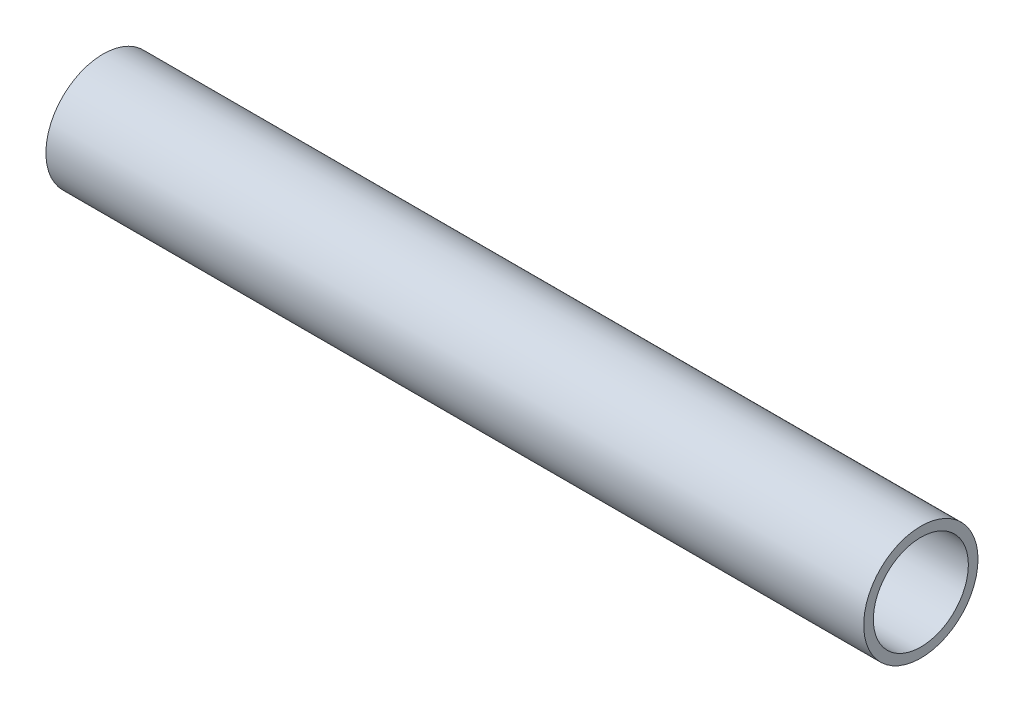
ISO-10303-21;
HEADER;
FILE_DESCRIPTION(('STEP AP214'),'2;1');
FILE_NAME('part.step','',(''),(''),'','','');
FILE_SCHEMA(('AUTOMOTIVE_DESIGN { 1 0 10303 214 1 1 1 1 }'));
ENDSEC;
DATA;
#1=APPLICATION_CONTEXT('core data for automotive mechanical design processes');
#2=APPLICATION_PROTOCOL_DEFINITION('international standard','automotive_design',2000,#1);
#3=PRODUCT_CONTEXT('',#1,'mechanical');
#4=PRODUCT('Part','Part','',(#3));
#5=PRODUCT_RELATED_PRODUCT_CATEGORY('part','',(#4));
#6=PRODUCT_DEFINITION_FORMATION('','',#4);
#7=PRODUCT_DEFINITION_CONTEXT('part definition',#1,'design');
#8=PRODUCT_DEFINITION('design','',#6,#7);
#9=PRODUCT_DEFINITION_SHAPE('','',#8);
#10=(LENGTH_UNIT() NAMED_UNIT(*) SI_UNIT(.MILLI.,.METRE.));
#11=(NAMED_UNIT(*) PLANE_ANGLE_UNIT() SI_UNIT($,.RADIAN.));
#12=(NAMED_UNIT(*) SI_UNIT($,.STERADIAN.) SOLID_ANGLE_UNIT());
#13=UNCERTAINTY_MEASURE_WITH_UNIT(LENGTH_MEASURE(1.E-05),#10,'distance_accuracy_value','');
#14=(GEOMETRIC_REPRESENTATION_CONTEXT(3) GLOBAL_UNCERTAINTY_ASSIGNED_CONTEXT((#13)) GLOBAL_UNIT_ASSIGNED_CONTEXT((#10,
#11,#12)) REPRESENTATION_CONTEXT('',''));
#15=CARTESIAN_POINT('',(0.,0.,0.));
#16=DIRECTION('',(0.,0.,1.));
#17=DIRECTION('',(1.,0.,0.));
#18=AXIS2_PLACEMENT_3D('',#15,#16,#17);
#19=CARTESIAN_POINT('',(-174.625,0.,0.));
#20=DIRECTION('',(1.,0.,0.));
#21=DIRECTION('',(0.,0.,-1.));
#22=AXIS2_PLACEMENT_3D('',#19,#20,#21);
#23=CYLINDRICAL_SURFACE('',#22,21.082);
#24=CARTESIAN_POINT('',(-95.25,0.,-21.082));
#25=CARTESIAN_POINT('',(-95.2500073037573,-0.177265588906064,-21.0819971511082));
#26=CARTESIAN_POINT('',(-95.2648956722781,-0.354633825443564,-21.0797407978607));
#27=CARTESIAN_POINT('',(-95.3240403602155,-0.704412011201185,-21.0709569196678));
#28=CARTESIAN_POINT('',(-95.3683252199961,-0.876816971803983,-21.064425243998));
#29=CARTESIAN_POINT('',(-95.4849091388346,-1.21155604974819,-21.0478246855302));
#30=CARTESIAN_POINT('',(-95.5571869641717,-1.37389769247853,-21.0377584843423));
#31=CARTESIAN_POINT('',(-95.7276530975323,-1.68412370373539,-21.0152009969064));
#32=CARTESIAN_POINT('',(-95.8258378289602,-1.83201006403648,-21.0027100454717));
#33=CARTESIAN_POINT('',(-96.0461542058056,-2.1103164343508,-20.9765819826565));
#34=CARTESIAN_POINT('',(-96.1684495601003,-2.24060616148058,-20.9629374218632));
#35=CARTESIAN_POINT('',(-96.4331633864275,-2.47889671955908,-20.9360982303561));
#36=CARTESIAN_POINT('',(-96.5755830188655,-2.58689626432783,-20.9229036256421));
#37=CARTESIAN_POINT('',(-96.8773786544134,-2.77804840978028,-20.8983859912104));
#38=CARTESIAN_POINT('',(-97.0368354067939,-2.86107486347092,-20.8870725883659));
#39=CARTESIAN_POINT('',(-97.3676295731584,-2.99911783525677,-20.8677000439257));
#40=CARTESIAN_POINT('',(-97.5389663337644,-3.05413589237424,-20.8596407235276));
#41=CARTESIAN_POINT('',(-97.8872863628436,-3.13419550245968,-20.8477621012251));
#42=CARTESIAN_POINT('',(-98.0642172558634,-3.15946016290709,-20.8439112577396));
#43=CARTESIAN_POINT('',(-98.419845943067,-3.17998699422211,-20.8407898425614));
#44=CARTESIAN_POINT('',(-98.5985436343971,-3.17525090142445,-20.8415190057945));
#45=CARTESIAN_POINT('',(-98.9510567099515,-3.13609297404926,-20.8474463775802));
#46=CARTESIAN_POINT('',(-99.1249004248299,-3.101919701057,-20.852607165254));
#47=CARTESIAN_POINT('',(-99.4643579756068,-3.00524659900985,-20.8667578327125));
#48=CARTESIAN_POINT('',(-99.6299715768266,-2.94274596272441,-20.8757478216156));
#49=CARTESIAN_POINT('',(-99.9490235812398,-2.7909340011809,-20.8965852461813));
#50=CARTESIAN_POINT('',(-100.102411162019,-2.70151746318004,-20.9084438587404));
#51=CARTESIAN_POINT('',(-100.392099144084,-2.498486828096,-20.9336742925736));
#52=CARTESIAN_POINT('',(-100.528398414064,-2.38487113028628,-20.9470462139227));
#53=CARTESIAN_POINT('',(-100.781481243325,-2.1353032656861,-20.9739618878806));
#54=CARTESIAN_POINT('',(-100.898054144489,-1.9991374095518,-20.9875060134767));
#55=CARTESIAN_POINT('',(-101.106725455512,-1.70906259522473,-21.0131148002247));
#56=CARTESIAN_POINT('',(-101.198823756631,-1.55515355820368,-21.0251794548033));
#57=CARTESIAN_POINT('',(-101.355942659601,-1.23377816277264,-21.0464826923882));
#58=CARTESIAN_POINT('',(-101.420946926471,-1.06630369822491,-21.0557195696406));
#59=CARTESIAN_POINT('',(-101.521848958346,-0.722645240857131,-21.070312259879));
#60=CARTESIAN_POINT('',(-101.557748707077,-0.546461842495156,-21.0756683373726));
#61=CARTESIAN_POINT('',(-101.599142333219,-0.192204765370484,-21.0818608911754));
#62=CARTESIAN_POINT('',(-101.604925808796,-0.0141656498471117,-21.0827404122035));
#63=CARTESIAN_POINT('',(-101.586691518388,0.340339952440575,-21.0799979514801));
#64=CARTESIAN_POINT('',(-101.562674682621,0.516806488119838,-21.0763761102388));
#65=CARTESIAN_POINT('',(-101.485762333879,0.862279899383912,-21.0650645063623));
#66=CARTESIAN_POINT('',(-101.433007989693,1.03131891039134,-21.0573946347692));
#67=CARTESIAN_POINT('',(-101.300267051749,1.35815274399449,-21.0388441665934));
#68=CARTESIAN_POINT('',(-101.220279170212,1.51594703443953,-21.0279634181826));
#69=CARTESIAN_POINT('',(-101.034662860785,1.8170851157619,-21.0040933283749));
#70=CARTESIAN_POINT('',(-100.928850826916,1.9603145348408,-20.9910891189132));
#71=CARTESIAN_POINT('',(-100.694845351182,2.22708618632573,-20.9644655933992));
#72=CARTESIAN_POINT('',(-100.566650597521,2.35062726403486,-20.9508462413297));
#73=CARTESIAN_POINT('',(-100.290229093112,2.57556977848285,-20.9243908347895));
#74=CARTESIAN_POINT('',(-100.141843493739,2.67677703259561,-20.9115622997957));
#75=CARTESIAN_POINT('',(-99.8300080053974,2.85282903090451,-20.888274456038));
#76=CARTESIAN_POINT('',(-99.6665585261644,2.92767449187153,-20.8778150828597));
#77=CARTESIAN_POINT('',(-99.3298127983176,3.04857772519442,-20.8605043047131));
#78=CARTESIAN_POINT('',(-99.156553855138,3.09473749350593,-20.8536401303661));
#79=CARTESIAN_POINT('',(-98.8046316089195,3.15728352894343,-20.8442630448294));
#80=CARTESIAN_POINT('',(-98.6259686832474,3.17367187018762,-20.8417498305174));
#81=CARTESIAN_POINT('',(-98.2702456638402,3.17616021106898,-20.8413705974415));
#82=CARTESIAN_POINT('',(-98.0931876803551,3.16256554437416,-20.8434577306442));
#83=CARTESIAN_POINT('',(-97.7439067922048,3.10612829026899,-20.8519421795031));
#84=CARTESIAN_POINT('',(-97.5716838795403,3.0632857512491,-20.8583394880282));
#85=CARTESIAN_POINT('',(-97.2370476835853,2.94967717748468,-20.874707044174));
#86=CARTESIAN_POINT('',(-97.0746269537971,2.87893265513937,-20.8846745386426));
#87=CARTESIAN_POINT('',(-96.7639105714977,2.71155871536682,-20.9070627102117));
#88=CARTESIAN_POINT('',(-96.6156154052644,2.61492840724794,-20.9194834717215));
#89=CARTESIAN_POINT('',(-96.3358087193127,2.39741725845485,-20.9455292166376));
#90=CARTESIAN_POINT('',(-96.2044739082908,2.27631033164997,-20.9591647100844));
#91=CARTESIAN_POINT('',(-95.9638828183518,2.01376149306829,-20.9860159394496));
#92=CARTESIAN_POINT('',(-95.8546316769312,1.87231486257537,-20.9992315770924));
#93=CARTESIAN_POINT('',(-95.6607669697578,1.57217776718591,-21.0238378848768));
#94=CARTESIAN_POINT('',(-95.5762935254673,1.41339594518084,-21.0352180180234));
#95=CARTESIAN_POINT('',(-95.4353412780308,1.08380087043067,-21.0547677779054));
#96=CARTESIAN_POINT('',(-95.3788335193363,0.913000272113382,-21.0629407235248));
#97=CARTESIAN_POINT('',(-95.3082168635909,0.61786433248082,-21.0732924950954));
#98=CARTESIAN_POINT('',(-95.2864189599853,0.495349503289427,-21.0765410154751));
#99=CARTESIAN_POINT('',(-95.2573080583054,0.248573261637359,-21.0808957533839));
#100=CARTESIAN_POINT('',(-95.2499948780599,0.124311871162614,-21.0820019978558));
#101=CARTESIAN_POINT('',(-95.25,0.,-21.082));
#102=B_SPLINE_CURVE_WITH_KNOTS('',3,(#24,#25,#26,#27,#28,#29,#30,#31,#32,#33,#34,#35,#36,#37,
#38,#39,#40,#41,#42,#43,#44,#45,#46,#47,#48,#49,#50,#51,#52,#53,#54,#55,#56,#57,#58,#59,#60,#61,
#62,#63,#64,#65,#66,#67,#68,#69,#70,#71,#72,#73,#74,#75,#76,#77,#78,#79,#80,#81,#82,#83,#84,#85,
#86,#87,#88,#89,#90,#91,#92,#93,#94,#95,#96,#97,#98,#99,#100,#101),.UNSPECIFIED.,.T.,.F.,(4,2,2,
2,2,2,2,2,2,2,2,2,2,2,2,2,2,2,2,2,2,2,2,2,2,2,2,2,2,2,2,2,2,2,2,2,2,2,4),(0.,0.531342512429038,
1.06320164882558,1.5946581376531,2.12604129424767,2.66116512439551,3.19631982343617,
3.73413403476704,4.27191869076775,4.80564452954641,5.33933947849273,5.86857170164552,
6.39781900700991,6.92916258470441,7.46054132064733,7.99727852314497,8.53401811031673,
9.07108083107699,9.6081069432693,10.1399593459211,10.6717951472021,11.2010416383702,
11.730313159249,12.2634633412738,12.7966447804,13.3342937698578,13.8719281396386,
14.4076397711918,14.9433140793118,15.4735585288678,16.0038021011393,16.5336376528597,
17.0634914377811,17.5984835709691,18.1336000206727,18.6716867332597,19.2092151415009,
19.5818368843675,19.9544539408189),.UNSPECIFIED.);
#103=CARTESIAN_POINT('',(-95.25,0.,-21.082));
#104=VERTEX_POINT('',#103);
#105=EDGE_CURVE('E76',#104,#104,#102,.T.);
#106=ORIENTED_EDGE('',*,*,#105,.F.);
#107=EDGE_LOOP('',(#106));
#108=FACE_BOUND('',#107,.T.);
#109=CARTESIAN_POINT('',(-146.05,0.,-21.082));
#110=CARTESIAN_POINT('',(-146.050007303757,-0.177265588906064,-21.0819971511082));
#111=CARTESIAN_POINT('',(-146.064895672278,-0.354633825443566,-21.0797407978607));
#112=CARTESIAN_POINT('',(-146.124040360215,-0.704412011201187,-21.0709569196678));
#113=CARTESIAN_POINT('',(-146.168325219996,-0.876816971803985,-21.064425243998));
#114=CARTESIAN_POINT('',(-146.284909138835,-1.21155604974819,-21.0478246855302));
#115=CARTESIAN_POINT('',(-146.357186964172,-1.37389769247854,-21.0377584843423));
#116=CARTESIAN_POINT('',(-146.527653097532,-1.6841237037354,-21.0152009969064));
#117=CARTESIAN_POINT('',(-146.62583782896,-1.8320100640365,-21.0027100454717));
#118=CARTESIAN_POINT('',(-146.846154205806,-2.11031643435081,-20.9765819826565));
#119=CARTESIAN_POINT('',(-146.9684495601,-2.24060616148059,-20.9629374218632));
#120=CARTESIAN_POINT('',(-147.233163386427,-2.47889671955909,-20.9360982303561));
#121=CARTESIAN_POINT('',(-147.375583018865,-2.58689626432784,-20.9229036256421));
#122=CARTESIAN_POINT('',(-147.677378654413,-2.77804840978029,-20.8983859912104));
#123=CARTESIAN_POINT('',(-147.836835406794,-2.86107486347093,-20.8870725883659));
#124=CARTESIAN_POINT('',(-148.167629573158,-2.99911783525678,-20.8677000439257));
#125=CARTESIAN_POINT('',(-148.338966333764,-3.05413589237425,-20.8596407235276));
#126=CARTESIAN_POINT('',(-148.687286362844,-3.13419550245969,-20.8477621012251));
#127=CARTESIAN_POINT('',(-148.864217255863,-3.15946016290709,-20.8439112577396));
#128=CARTESIAN_POINT('',(-149.219845943067,-3.17998699422211,-20.8407898425614));
#129=CARTESIAN_POINT('',(-149.398543634397,-3.17525090142445,-20.8415190057945));
#130=CARTESIAN_POINT('',(-149.751056709951,-3.13609297404926,-20.8474463775802));
#131=CARTESIAN_POINT('',(-149.92490042483,-3.101919701057,-20.852607165254));
#132=CARTESIAN_POINT('',(-150.264357975607,-3.00524659900985,-20.8667578327125));
#133=CARTESIAN_POINT('',(-150.429971576827,-2.9427459627244,-20.8757478216156));
#134=CARTESIAN_POINT('',(-150.74902358124,-2.79093400118089,-20.8965852461813));
#135=CARTESIAN_POINT('',(-150.902411162019,-2.70151746318001,-20.9084438587404));
#136=CARTESIAN_POINT('',(-151.192099144084,-2.49848682809597,-20.9336742925736));
#137=CARTESIAN_POINT('',(-151.328398414064,-2.38487113028625,-20.9470462139227));
#138=CARTESIAN_POINT('',(-151.581481243325,-2.13530326568607,-20.9739618878807));
#139=CARTESIAN_POINT('',(-151.698054144489,-1.99913740955177,-20.9875060134767));
#140=CARTESIAN_POINT('',(-151.906725455512,-1.70906259522471,-21.0131148002247));
#141=CARTESIAN_POINT('',(-151.998823756631,-1.55515355820366,-21.0251794548033));
#142=CARTESIAN_POINT('',(-152.155942659601,-1.23377816277263,-21.0464826923882));
#143=CARTESIAN_POINT('',(-152.220946926471,-1.0663036982249,-21.0557195696406));
#144=CARTESIAN_POINT('',(-152.321848958346,-0.722645240857127,-21.070312259879));
#145=CARTESIAN_POINT('',(-152.357748707077,-0.546461842495151,-21.0756683373726));
#146=CARTESIAN_POINT('',(-152.399142333219,-0.192204765370476,-21.0818608911754));
#147=CARTESIAN_POINT('',(-152.404925808796,-0.014165649847103,-21.0827404122035));
#148=CARTESIAN_POINT('',(-152.386691518388,0.340339952440583,-21.0799979514801));
#149=CARTESIAN_POINT('',(-152.362674682621,0.516806488119846,-21.0763761102388));
#150=CARTESIAN_POINT('',(-152.285762333879,0.86227989938392,-21.0650645063623));
#151=CARTESIAN_POINT('',(-152.233007989693,1.03131891039135,-21.0573946347692));
#152=CARTESIAN_POINT('',(-152.100267051749,1.3581527439945,-21.0388441665934));
#153=CARTESIAN_POINT('',(-152.020279170212,1.51594703443955,-21.0279634181826));
#154=CARTESIAN_POINT('',(-151.834662860785,1.8170851157619,-21.0040933283749));
#155=CARTESIAN_POINT('',(-151.728850826916,1.96031453484078,-20.9910891189132));
#156=CARTESIAN_POINT('',(-151.494845351182,2.22708618632572,-20.9644655933992));
#157=CARTESIAN_POINT('',(-151.366650597521,2.35062726403487,-20.9508462413297));
#158=CARTESIAN_POINT('',(-151.090229093112,2.57556977848286,-20.9243908347895));
#159=CARTESIAN_POINT('',(-150.941843493739,2.67677703259561,-20.9115622997957));
#160=CARTESIAN_POINT('',(-150.630008005397,2.8528290309045,-20.888274456038));
#161=CARTESIAN_POINT('',(-150.466558526164,2.92767449187153,-20.8778150828597));
#162=CARTESIAN_POINT('',(-150.129812798318,3.04857772519442,-20.8605043047131));
#163=CARTESIAN_POINT('',(-149.956553855138,3.09473749350594,-20.8536401303661));
#164=CARTESIAN_POINT('',(-149.604631608919,3.15728352894343,-20.8442630448294));
#165=CARTESIAN_POINT('',(-149.425968683247,3.17367187018762,-20.8417498305174));
#166=CARTESIAN_POINT('',(-149.07024566384,3.17616021106899,-20.8413705974415));
#167=CARTESIAN_POINT('',(-148.893187680355,3.16256554437416,-20.8434577306442));
#168=CARTESIAN_POINT('',(-148.543906792205,3.10612829026899,-20.8519421795031));
#169=CARTESIAN_POINT('',(-148.37168387954,3.0632857512491,-20.8583394880282));
#170=CARTESIAN_POINT('',(-148.037047683585,2.94967717748468,-20.874707044174));
#171=CARTESIAN_POINT('',(-147.874626953797,2.87893265513936,-20.8846745386426));
#172=CARTESIAN_POINT('',(-147.563910571498,2.71155871536682,-20.9070627102117));
#173=CARTESIAN_POINT('',(-147.415615405264,2.61492840724794,-20.9194834717215));
#174=CARTESIAN_POINT('',(-147.135808719313,2.39741725845485,-20.9455292166376));
#175=CARTESIAN_POINT('',(-147.004473908291,2.27631033164997,-20.9591647100844));
#176=CARTESIAN_POINT('',(-146.763882818352,2.01376149306828,-20.9860159394496));
#177=CARTESIAN_POINT('',(-146.654631676931,1.87231486257536,-20.9992315770924));
#178=CARTESIAN_POINT('',(-146.460766969758,1.57217776718591,-21.0238378848768));
#179=CARTESIAN_POINT('',(-146.376293525467,1.41339594518084,-21.0352180180234));
#180=CARTESIAN_POINT('',(-146.235341278031,1.08380087043067,-21.0547677779054));
#181=CARTESIAN_POINT('',(-146.178833519336,0.913000272113373,-21.0629407235248));
#182=CARTESIAN_POINT('',(-146.108216863591,0.617864332480807,-21.0732924950954));
#183=CARTESIAN_POINT('',(-146.086418959985,0.495349503289417,-21.0765410154751));
#184=CARTESIAN_POINT('',(-146.057308058305,0.248573261637354,-21.0808957533839));
#185=CARTESIAN_POINT('',(-146.04999487806,0.124311871162612,-21.0820019978558));
#186=CARTESIAN_POINT('',(-146.05,0.,-21.082));
#187=B_SPLINE_CURVE_WITH_KNOTS('',3,(#109,#110,#111,#112,#113,#114,#115,#116,#117,#118,#119,
#120,#121,#122,#123,#124,#125,#126,#127,#128,#129,#130,#131,#132,#133,#134,#135,#136,#137,#138,
#139,#140,#141,#142,#143,#144,#145,#146,#147,#148,#149,#150,#151,#152,#153,#154,#155,#156,#157,
#158,#159,#160,#161,#162,#163,#164,#165,#166,#167,#168,#169,#170,#171,#172,#173,#174,#175,#176,
#177,#178,#179,#180,#181,#182,#183,#184,#185,#186),.UNSPECIFIED.,.T.,.F.,(4,2,2,2,2,2,2,2,2,2,2,
2,2,2,2,2,2,2,2,2,2,2,2,2,2,2,2,2,2,2,2,2,2,2,2,2,2,2,4),(0.,0.53134251242904,1.06320164882559,
1.59465813765311,2.12604129424768,2.66116512439553,3.19631982343618,3.73413403476707,
4.27191869076778,4.80564452954643,5.33933947849274,5.86857170164554,6.39781900700992,
6.92916258470446,7.46054132064736,7.99727852314501,8.53401811031675,9.071080831077,
9.60810694326931,10.1399593459211,10.6717951472021,11.2010416383702,11.730313159249,
12.2634633412738,12.7966447804,13.3342937698578,13.8719281396386,14.4076397711918,
14.9433140793118,15.4735585288678,16.0038021011393,16.5336376528597,17.0634914377811,
17.5984835709691,18.1336000206728,18.6716867332597,19.2092151415009,19.5818368843675,
19.9544539408189),.UNSPECIFIED.);
#188=CARTESIAN_POINT('',(-146.05,0.,-21.082));
#189=VERTEX_POINT('',#188);
#190=EDGE_CURVE('E58',#189,#189,#187,.T.);
#191=ORIENTED_EDGE('',*,*,#190,.F.);
#192=EDGE_LOOP('',(#191));
#193=FACE_BOUND('',#192,.T.);
#194=CARTESIAN_POINT('',(-174.625,0.,0.));
#195=DIRECTION('',(1.,0.,0.));
#196=DIRECTION('',(0.,0.,-1.));
#197=AXIS2_PLACEMENT_3D('',#194,#195,#196);
#198=CIRCLE('',#197,21.082);
#199=CARTESIAN_POINT('',(-174.625,0.,-21.082));
#200=VERTEX_POINT('',#199);
#201=EDGE_CURVE('E10',#200,#200,#198,.T.);
#202=ORIENTED_EDGE('',*,*,#201,.T.);
#203=EDGE_LOOP('',(#202));
#204=FACE_BOUND('',#203,.T.);
#205=CARTESIAN_POINT('',(127.,0.,0.));
#206=DIRECTION('',(1.,0.,0.));
#207=DIRECTION('',(0.,0.,-1.));
#208=AXIS2_PLACEMENT_3D('',#205,#206,#207);
#209=CIRCLE('',#208,21.082);
#210=CARTESIAN_POINT('',(127.,0.,-21.082));
#211=VERTEX_POINT('',#210);
#212=EDGE_CURVE('E49',#211,#211,#209,.T.);
#213=ORIENTED_EDGE('',*,*,#212,.F.);
#214=EDGE_LOOP('',(#213));
#215=FACE_BOUND('',#214,.T.);
#216=ADVANCED_FACE('F31',(#108,#193,#204,#215),#23,.T.);
#217=CARTESIAN_POINT('',(-174.625,0.,0.));
#218=DIRECTION('',(1.,0.,0.));
#219=DIRECTION('',(0.,0.,-1.));
#220=AXIS2_PLACEMENT_3D('',#217,#218,#219);
#221=PLANE('',#220);
#222=CARTESIAN_POINT('',(-174.625,0.,0.));
#223=DIRECTION('',(1.,0.,0.));
#224=DIRECTION('',(0.,0.,-1.));
#225=AXIS2_PLACEMENT_3D('',#222,#223,#224);
#226=CIRCLE('',#225,17.526);
#227=CARTESIAN_POINT('',(-174.625,0.,-17.526));
#228=VERTEX_POINT('',#227);
#229=EDGE_CURVE('E44',#228,#228,#226,.T.);
#230=ORIENTED_EDGE('',*,*,#229,.T.);
#231=EDGE_LOOP('',(#230));
#232=FACE_BOUND('',#231,.T.);
#233=ORIENTED_EDGE('',*,*,#201,.F.);
#234=EDGE_LOOP('',(#233));
#235=FACE_BOUND('',#234,.T.);
#236=ADVANCED_FACE('F90',(#232,#235),#221,.F.);
#237=CARTESIAN_POINT('',(-174.625,0.,0.));
#238=DIRECTION('',(1.,0.,0.));
#239=DIRECTION('',(0.,0.,-1.));
#240=AXIS2_PLACEMENT_3D('',#237,#238,#239);
#241=CYLINDRICAL_SURFACE('',#240,17.526);
#242=CARTESIAN_POINT('',(-101.6,0.,-17.526));
#243=CARTESIAN_POINT('',(-101.599993132515,0.17679082350801,-17.5259968412274));
#244=CARTESIAN_POINT('',(-101.585183965731,0.353672270747988,-17.5232972774411));
#245=CARTESIAN_POINT('',(-101.526372438004,0.702458155041369,-17.5127883009458));
#246=CARTESIAN_POINT('',(-101.482344740396,0.874358137310072,-17.5049744534986));
#247=CARTESIAN_POINT('',(-101.366482418544,1.20808580036967,-17.485111731742));
#248=CARTESIAN_POINT('',(-101.29467216344,1.36992216434489,-17.4730665697294));
#249=CARTESIAN_POINT('',(-101.125350679922,1.67923272236702,-17.4460593997375));
#250=CARTESIAN_POINT('',(-101.027841801324,1.82670822784651,-17.4310976584752));
#251=CARTESIAN_POINT('',(-100.808729501993,2.10478127681952,-17.3997234174553));
#252=CARTESIAN_POINT('',(-100.686893953305,2.23519445696564,-17.3832978577657));
#253=CARTESIAN_POINT('',(-100.423086238519,2.47384671567764,-17.3509451203049));
#254=CARTESIAN_POINT('',(-100.281112684689,2.58208426483874,-17.3350179769725));
#255=CARTESIAN_POINT('',(-99.97976755925,2.77407084888639,-17.3053386524232));
#256=CARTESIAN_POINT('',(-99.82027574471,2.8576339824516,-17.2916033234658));
#257=CARTESIAN_POINT('',(-99.4892275026837,2.99671002667021,-17.2680459841376));
#258=CARTESIAN_POINT('',(-99.3176720447767,3.05222518866685,-17.2582236596927));
#259=CARTESIAN_POINT('',(-98.9693334205962,3.13304110203761,-17.2437354838221));
#260=CARTESIAN_POINT('',(-98.7926269370351,3.15866238598856,-17.2390149702052));
#261=CARTESIAN_POINT('',(-98.4373650062532,3.17995782064228,-17.235099927382));
#262=CARTESIAN_POINT('',(-98.2588097149559,3.1756344765814,-17.2359049358977));
#263=CARTESIAN_POINT('',(-97.9072300510038,3.13742365897766,-17.2429001682717));
#264=CARTESIAN_POINT('',(-97.7341647086679,3.10389926153133,-17.2490242538492));
#265=CARTESIAN_POINT('',(-97.3961562140921,3.00880912932249,-17.2658638407267));
#266=CARTESIAN_POINT('',(-97.231213386391,2.94724227511612,-17.2765795253205));
#267=CARTESIAN_POINT('',(-96.9130619363625,2.79745571266688,-17.3014647929721));
#268=CARTESIAN_POINT('',(-96.7599245079335,2.7090880872545,-17.3156534578234));
#269=CARTESIAN_POINT('',(-96.470514150003,2.50831315208051,-17.3458731721502));
#270=CARTESIAN_POINT('',(-96.3342428236547,2.39590355985285,-17.3619043964854));
#271=CARTESIAN_POINT('',(-96.0803338962992,2.14827149301383,-17.3942918762038));
#272=CARTESIAN_POINT('',(-95.962999429291,2.01273815664841,-17.4106494468318));
#273=CARTESIAN_POINT('',(-95.7526886211131,1.72374960651158,-17.4416297211863));
#274=CARTESIAN_POINT('',(-95.6597124943575,1.57029423499867,-17.4562524096409));
#275=CARTESIAN_POINT('',(-95.500718396598,1.24951132270804,-17.4821419521182));
#276=CARTESIAN_POINT('',(-95.4347304486683,1.08216858038397,-17.4934050650234));
#277=CARTESIAN_POINT('',(-95.3318843483637,0.738524824278316,-17.5112771866033));
#278=CARTESIAN_POINT('',(-95.2950233103667,0.562224699752744,-17.5178866563105));
#279=CARTESIAN_POINT('',(-95.2518958271967,0.208280155645573,-17.5256438790602));
#280=CARTESIAN_POINT('',(-95.245213792981,0.0306879466818638,-17.5268658171028));
#281=CARTESIAN_POINT('',(-95.2615213711922,-0.323076767936696,-17.5239146703191));
#282=CARTESIAN_POINT('',(-95.2845096264779,-0.499249338156001,-17.5197418322538));
#283=CARTESIAN_POINT('',(-95.3591596423848,-0.843866600411555,-17.5065161011469));
#284=CARTESIAN_POINT('',(-95.4106125479722,-1.01235801735561,-17.4974987676082));
#285=CARTESIAN_POINT('',(-95.5405063595171,-1.33832313012139,-17.4755909179164));
#286=CARTESIAN_POINT('',(-95.6189490011885,-1.49579611656221,-17.4627001526692));
#287=CARTESIAN_POINT('',(-95.8015255027009,-1.7970379428255,-17.4342904171948));
#288=CARTESIAN_POINT('',(-95.9059150975122,-1.94064931955918,-17.4187457992515));
#289=CARTESIAN_POINT('',(-96.1370744185283,-2.20846506883692,-17.3868220571775));
#290=CARTESIAN_POINT('',(-96.2638460863583,-2.33266775593063,-17.3704428607355));
#291=CARTESIAN_POINT('',(-96.5380470534088,-2.55970748627499,-17.3384518393717));
#292=CARTESIAN_POINT('',(-96.6857120955064,-2.66226178053651,-17.3228519867864));
#293=CARTESIAN_POINT('',(-96.9964178334415,-2.84110984177048,-17.2944212278246));
#294=CARTESIAN_POINT('',(-97.1594579820262,-2.91740454296296,-17.2815902229488));
#295=CARTESIAN_POINT('',(-97.4955450343434,-3.04115979533501,-17.2602426012819));
#296=CARTESIAN_POINT('',(-97.6685416025097,-3.08875345587471,-17.2517060985603));
#297=CARTESIAN_POINT('',(-98.0202437321866,-3.15416897697809,-17.2398671271274));
#298=CARTESIAN_POINT('',(-98.1989486950753,-3.17199394891527,-17.2365641114227));
#299=CARTESIAN_POINT('',(-98.5541655418571,-3.17726742876193,-17.2355925385196));
#300=CARTESIAN_POINT('',(-98.7306707384355,-3.16516161695717,-17.2378413124165));
#301=CARTESIAN_POINT('',(-99.0790866320758,-3.11188910689162,-17.2475373034534));
#302=CARTESIAN_POINT('',(-99.2509973523558,-3.07072255551699,-17.2549844943182));
#303=CARTESIAN_POINT('',(-99.5851258972035,-2.96067981082377,-17.2742044563146));
#304=CARTESIAN_POINT('',(-99.7473590229442,-2.89184876708741,-17.2859701767276));
#305=CARTESIAN_POINT('',(-100.058046204287,-2.72847862049299,-17.3125070165183));
#306=CARTESIAN_POINT('',(-100.20649937582,-2.633937869728,-17.3272783285292));
#307=CARTESIAN_POINT('',(-100.487651300551,-2.42026944589855,-17.3584203635157));
#308=CARTESIAN_POINT('',(-100.620100559389,-2.30081626698696,-17.37481057328));
#309=CARTESIAN_POINT('',(-100.86322420719,-2.04139533634304,-17.4071948659678));
#310=CARTESIAN_POINT('',(-100.973893583025,-1.90142287454245,-17.4231888569539));
#311=CARTESIAN_POINT('',(-101.171171023297,-1.60354404533997,-17.4531342301883));
#312=CARTESIAN_POINT('',(-101.257571193469,-1.44549813095465,-17.4670675069251));
#313=CARTESIAN_POINT('',(-101.402456942508,-1.11693687333548,-17.4911451342375));
#314=CARTESIAN_POINT('',(-101.460969245347,-0.946433648982045,-17.5012931100993));
#315=CARTESIAN_POINT('',(-101.536276479759,-0.646146664812306,-17.5145413811557));
#316=CARTESIAN_POINT('',(-101.560132786512,-0.518138865968811,-17.5188145120769));
#317=CARTESIAN_POINT('',(-101.591996893811,-0.26010370060993,-17.5245449517082));
#318=CARTESIAN_POINT('',(-101.600005052851,-0.130076379844328,-17.5260023241122));
#319=CARTESIAN_POINT('',(-101.6,0.,-17.526));
#320=B_SPLINE_CURVE_WITH_KNOTS('',3,(#242,#243,#244,#245,#246,#247,#248,#249,#250,#251,#252,
#253,#254,#255,#256,#257,#258,#259,#260,#261,#262,#263,#264,#265,#266,#267,#268,#269,#270,#271,
#272,#273,#274,#275,#276,#277,#278,#279,#280,#281,#282,#283,#284,#285,#286,#287,#288,#289,#290,
#291,#292,#293,#294,#295,#296,#297,#298,#299,#300,#301,#302,#303,#304,#305,#306,#307,#308,#309,
#310,#311,#312,#313,#314,#315,#316,#317,#318,#319),.UNSPECIFIED.,.T.,.F.,(4,2,2,2,2,2,2,2,2,2,2,
2,2,2,2,2,2,2,2,2,2,2,2,2,2,2,2,2,2,2,2,2,2,2,2,2,2,2,4),(0.,0.52989684739867,1.06025379298761,
1.59014659312776,2.11999095802632,2.65515610450925,3.19035814774705,3.7294952286848,
4.26858902750702,4.80184775131232,5.33506186200683,5.86173930617047,6.38843777693352,
6.91809776769747,7.4478080649945,7.985299753981,8.52279617407827,9.06088891772033,
9.59892834547637,10.1295354893394,10.6601183636945,11.1868588327276,11.713633182854,
12.2458209999474,12.778055006572,13.3168607871052,13.8556473969222,14.3919156166157,
14.9281277829441,15.4564037756751,15.9846770982784,16.5120917356115,17.0395401864443,
17.5743685624972,18.1093198977251,18.6487229234539,19.1876080135939,19.5774960261897,
19.9673752191978),.UNSPECIFIED.);
#321=CARTESIAN_POINT('',(-101.6,0.,-17.526));
#322=VERTEX_POINT('',#321);
#323=EDGE_CURVE('E35',#322,#322,#320,.T.);
#324=ORIENTED_EDGE('',*,*,#323,.T.);
#325=EDGE_LOOP('',(#324));
#326=FACE_BOUND('',#325,.T.);
#327=CARTESIAN_POINT('',(-152.4,0.,-17.526));
#328=CARTESIAN_POINT('',(-152.399993132515,0.176790823508009,-17.5259968412274));
#329=CARTESIAN_POINT('',(-152.385183965731,0.353672270747985,-17.5232972774411));
#330=CARTESIAN_POINT('',(-152.326372438004,0.702458155041367,-17.5127883009458));
#331=CARTESIAN_POINT('',(-152.282344740396,0.874358137310074,-17.5049744534986));
#332=CARTESIAN_POINT('',(-152.166482418544,1.20808580036968,-17.485111731742));
#333=CARTESIAN_POINT('',(-152.09467216344,1.3699221643449,-17.4730665697294));
#334=CARTESIAN_POINT('',(-151.925350679922,1.67923272236704,-17.4460593997375));
#335=CARTESIAN_POINT('',(-151.827841801324,1.82670822784652,-17.4310976584752));
#336=CARTESIAN_POINT('',(-151.608729501993,2.10478127681953,-17.3997234174553));
#337=CARTESIAN_POINT('',(-151.486893953305,2.23519445696565,-17.3832978577657));
#338=CARTESIAN_POINT('',(-151.223086238519,2.47384671567765,-17.3509451203049));
#339=CARTESIAN_POINT('',(-151.081112684689,2.58208426483874,-17.3350179769725));
#340=CARTESIAN_POINT('',(-150.77976755925,2.77407084888639,-17.3053386524232));
#341=CARTESIAN_POINT('',(-150.62027574471,2.8576339824516,-17.2916033234658));
#342=CARTESIAN_POINT('',(-150.289227502684,2.99671002667021,-17.2680459841376));
#343=CARTESIAN_POINT('',(-150.117672044777,3.05222518866685,-17.2582236596927));
#344=CARTESIAN_POINT('',(-149.769333420596,3.13304110203761,-17.2437354838221));
#345=CARTESIAN_POINT('',(-149.592626937035,3.15866238598857,-17.2390149702052));
#346=CARTESIAN_POINT('',(-149.237365006253,3.17995782064228,-17.235099927382));
#347=CARTESIAN_POINT('',(-149.058809714956,3.1756344765814,-17.2359049358977));
#348=CARTESIAN_POINT('',(-148.707230051004,3.13742365897766,-17.2429001682717));
#349=CARTESIAN_POINT('',(-148.534164708668,3.10389926153133,-17.2490242538492));
#350=CARTESIAN_POINT('',(-148.196156214092,3.00880912932248,-17.2658638407267));
#351=CARTESIAN_POINT('',(-148.031213386391,2.94724227511611,-17.2765795253205));
#352=CARTESIAN_POINT('',(-147.713061936362,2.79745571266685,-17.3014647929721));
#353=CARTESIAN_POINT('',(-147.559924507933,2.70908808725447,-17.3156534578234));
#354=CARTESIAN_POINT('',(-147.270514150003,2.50831315208049,-17.3458731721502));
#355=CARTESIAN_POINT('',(-147.134242823655,2.39590355985283,-17.3619043964854));
#356=CARTESIAN_POINT('',(-146.880333896299,2.14827149301382,-17.3942918762038));
#357=CARTESIAN_POINT('',(-146.762999429291,2.01273815664841,-17.4106494468318));
#358=CARTESIAN_POINT('',(-146.552688621113,1.72374960651158,-17.4416297211863));
#359=CARTESIAN_POINT('',(-146.459712494357,1.57029423499867,-17.4562524096409));
#360=CARTESIAN_POINT('',(-146.300718396598,1.24951132270804,-17.4821419521182));
#361=CARTESIAN_POINT('',(-146.234730448668,1.08216858038396,-17.4934050650234));
#362=CARTESIAN_POINT('',(-146.131884348364,0.738524824278307,-17.5112771866033));
#363=CARTESIAN_POINT('',(-146.095023310367,0.562224699752732,-17.5178866563105));
#364=CARTESIAN_POINT('',(-146.051895827197,0.208280155645558,-17.5256438790602));
#365=CARTESIAN_POINT('',(-146.045213792981,0.0306879466818504,-17.5268658171028));
#366=CARTESIAN_POINT('',(-146.061521371192,-0.323076767936705,-17.5239146703191));
#367=CARTESIAN_POINT('',(-146.084509626478,-0.499249338156009,-17.5197418322538));
#368=CARTESIAN_POINT('',(-146.159159642385,-0.843866600411558,-17.5065161011469));
#369=CARTESIAN_POINT('',(-146.210612547972,-1.01235801735561,-17.4974987676082));
#370=CARTESIAN_POINT('',(-146.340506359517,-1.3383231301214,-17.4755909179164));
#371=CARTESIAN_POINT('',(-146.418949001188,-1.49579611656221,-17.4627001526692));
#372=CARTESIAN_POINT('',(-146.601525502701,-1.79703794282551,-17.4342904171948));
#373=CARTESIAN_POINT('',(-146.705915097512,-1.94064931955918,-17.4187457992515));
#374=CARTESIAN_POINT('',(-146.937074418528,-2.20846506883692,-17.3868220571775));
#375=CARTESIAN_POINT('',(-147.063846086358,-2.33266775593063,-17.3704428607355));
#376=CARTESIAN_POINT('',(-147.338047053409,-2.559707486275,-17.3384518393717));
#377=CARTESIAN_POINT('',(-147.485712095506,-2.66226178053653,-17.3228519867864));
#378=CARTESIAN_POINT('',(-147.796417833441,-2.84110984177049,-17.2944212278246));
#379=CARTESIAN_POINT('',(-147.959457982026,-2.91740454296297,-17.2815902229488));
#380=CARTESIAN_POINT('',(-148.295545034343,-3.04115979533501,-17.2602426012819));
#381=CARTESIAN_POINT('',(-148.46854160251,-3.08875345587471,-17.2517060985603));
#382=CARTESIAN_POINT('',(-148.820243732187,-3.1541689769781,-17.2398671271274));
#383=CARTESIAN_POINT('',(-148.998948695075,-3.17199394891528,-17.2365641114227));
#384=CARTESIAN_POINT('',(-149.354165541857,-3.17726742876193,-17.2355925385196));
#385=CARTESIAN_POINT('',(-149.530670738435,-3.16516161695717,-17.2378413124165));
#386=CARTESIAN_POINT('',(-149.879086632076,-3.11188910689162,-17.2475373034534));
#387=CARTESIAN_POINT('',(-150.050997352356,-3.07072255551698,-17.2549844943182));
#388=CARTESIAN_POINT('',(-150.385125897204,-2.96067981082376,-17.2742044563146));
#389=CARTESIAN_POINT('',(-150.547359022944,-2.8918487670874,-17.2859701767276));
#390=CARTESIAN_POINT('',(-150.858046204287,-2.72847862049297,-17.3125070165183));
#391=CARTESIAN_POINT('',(-151.00649937582,-2.63393786972798,-17.3272783285293));
#392=CARTESIAN_POINT('',(-151.287651300551,-2.42026944589853,-17.3584203635157));
#393=CARTESIAN_POINT('',(-151.420100559389,-2.30081626698695,-17.37481057328));
#394=CARTESIAN_POINT('',(-151.66322420719,-2.04139533634303,-17.4071948659678));
#395=CARTESIAN_POINT('',(-151.773893583025,-1.90142287454244,-17.4231888569539));
#396=CARTESIAN_POINT('',(-151.971171023297,-1.60354404533996,-17.4531342301883));
#397=CARTESIAN_POINT('',(-152.057571193469,-1.44549813095464,-17.4670675069251));
#398=CARTESIAN_POINT('',(-152.202456942508,-1.11693687333546,-17.4911451342375));
#399=CARTESIAN_POINT('',(-152.260969245347,-0.946433648982028,-17.5012931100993));
#400=CARTESIAN_POINT('',(-152.336276479759,-0.646146664812287,-17.5145413811557));
#401=CARTESIAN_POINT('',(-152.360132786512,-0.518138865968793,-17.5188145120769));
#402=CARTESIAN_POINT('',(-152.391996893811,-0.260103700609919,-17.5245449517082));
#403=CARTESIAN_POINT('',(-152.400005052851,-0.130076379844322,-17.5260023241122));
#404=CARTESIAN_POINT('',(-152.4,0.,-17.526));
#405=B_SPLINE_CURVE_WITH_KNOTS('',3,(#327,#328,#329,#330,#331,#332,#333,#334,#335,#336,#337,
#338,#339,#340,#341,#342,#343,#344,#345,#346,#347,#348,#349,#350,#351,#352,#353,#354,#355,#356,
#357,#358,#359,#360,#361,#362,#363,#364,#365,#366,#367,#368,#369,#370,#371,#372,#373,#374,#375,
#376,#377,#378,#379,#380,#381,#382,#383,#384,#385,#386,#387,#388,#389,#390,#391,#392,#393,#394,
#395,#396,#397,#398,#399,#400,#401,#402,#403,#404),.UNSPECIFIED.,.T.,.F.,(4,2,2,2,2,2,2,2,2,2,2,
2,2,2,2,2,2,2,2,2,2,2,2,2,2,2,2,2,2,2,2,2,2,2,2,2,2,2,4),(0.,0.52989684739867,1.06025379298762,
1.59014659312777,2.11999095802633,2.65515610450925,3.19035814774706,3.72949522868482,
4.26858902750703,4.80184775131235,5.33506186200683,5.86173930617047,6.3884377769336,
6.91809776769754,7.44780806499452,7.985299753981,8.52279617407827,9.06088891772035,
9.59892834547639,10.1295354893394,10.6601183636946,11.1868588327276,11.713633182854,
12.2458209999474,12.778055006572,13.3168607871052,13.8556473969223,14.3919156166158,
14.9281277829441,15.4564037756751,15.9846770982785,16.5120917356116,17.0395401864443,
17.5743685624972,18.1093198977252,18.648722923454,19.1876080135939,19.5774960261897,
19.9673752191978),.UNSPECIFIED.);
#406=CARTESIAN_POINT('',(-152.4,0.,-17.526));
#407=VERTEX_POINT('',#406);
#408=EDGE_CURVE('E52',#407,#407,#405,.T.);
#409=ORIENTED_EDGE('',*,*,#408,.T.);
#410=EDGE_LOOP('',(#409));
#411=FACE_BOUND('',#410,.T.);
#412=ORIENTED_EDGE('',*,*,#229,.F.);
#413=EDGE_LOOP('',(#412));
#414=FACE_BOUND('',#413,.T.);
#415=CARTESIAN_POINT('',(127.,0.,0.));
#416=DIRECTION('',(1.,0.,0.));
#417=DIRECTION('',(0.,0.,-1.));
#418=AXIS2_PLACEMENT_3D('',#415,#416,#417);
#419=CIRCLE('',#418,17.526);
#420=CARTESIAN_POINT('',(127.,0.,-17.526));
#421=VERTEX_POINT('',#420);
#422=EDGE_CURVE('E82',#421,#421,#419,.T.);
#423=ORIENTED_EDGE('',*,*,#422,.T.);
#424=EDGE_LOOP('',(#423));
#425=FACE_BOUND('',#424,.T.);
#426=ADVANCED_FACE('F59',(#326,#411,#414,#425),#241,.F.);
#427=CARTESIAN_POINT('',(127.,0.,0.));
#428=DIRECTION('',(1.,0.,0.));
#429=DIRECTION('',(0.,0.,-1.));
#430=AXIS2_PLACEMENT_3D('',#427,#428,#429);
#431=PLANE('',#430);
#432=ORIENTED_EDGE('',*,*,#212,.T.);
#433=EDGE_LOOP('',(#432));
#434=FACE_BOUND('',#433,.T.);
#435=ORIENTED_EDGE('',*,*,#422,.F.);
#436=EDGE_LOOP('',(#435));
#437=FACE_BOUND('',#436,.T.);
#438=ADVANCED_FACE('F66',(#434,#437),#431,.T.);
#439=CARTESIAN_POINT('',(-149.225,0.,-21.082));
#440=DIRECTION('',(0.,0.,1.));
#441=DIRECTION('',(1.,0.,0.));
#442=AXIS2_PLACEMENT_3D('',#439,#440,#441);
#443=CYLINDRICAL_SURFACE('',#442,3.17500000000009);
#444=ORIENTED_EDGE('',*,*,#190,.T.);
#445=EDGE_LOOP('',(#444));
#446=FACE_BOUND('',#445,.T.);
#447=ORIENTED_EDGE('',*,*,#408,.F.);
#448=EDGE_LOOP('',(#447));
#449=FACE_BOUND('',#448,.T.);
#450=ADVANCED_FACE('F62',(#446,#449),#443,.F.);
#451=CARTESIAN_POINT('',(-98.4250000000001,0.,-21.082));
#452=DIRECTION('',(0.,0.,1.));
#453=DIRECTION('',(1.,0.,0.));
#454=AXIS2_PLACEMENT_3D('',#451,#452,#453);
#455=CYLINDRICAL_SURFACE('',#454,3.17500000000008);
#456=ORIENTED_EDGE('',*,*,#105,.T.);
#457=EDGE_LOOP('',(#456));
#458=FACE_BOUND('',#457,.T.);
#459=ORIENTED_EDGE('',*,*,#323,.F.);
#460=EDGE_LOOP('',(#459));
#461=FACE_BOUND('',#460,.T.);
#462=ADVANCED_FACE('F65',(#458,#461),#455,.F.);
#463=CLOSED_SHELL('',(#216,#236,#426,#438,#450,#462));
#464=MANIFOLD_SOLID_BREP('B2',#463);
#465=ADVANCED_BREP_SHAPE_REPRESENTATION('',(#18,#464),#14);
#466=SHAPE_DEFINITION_REPRESENTATION(#9,#465);
ENDSEC;
END-ISO-10303-21;
